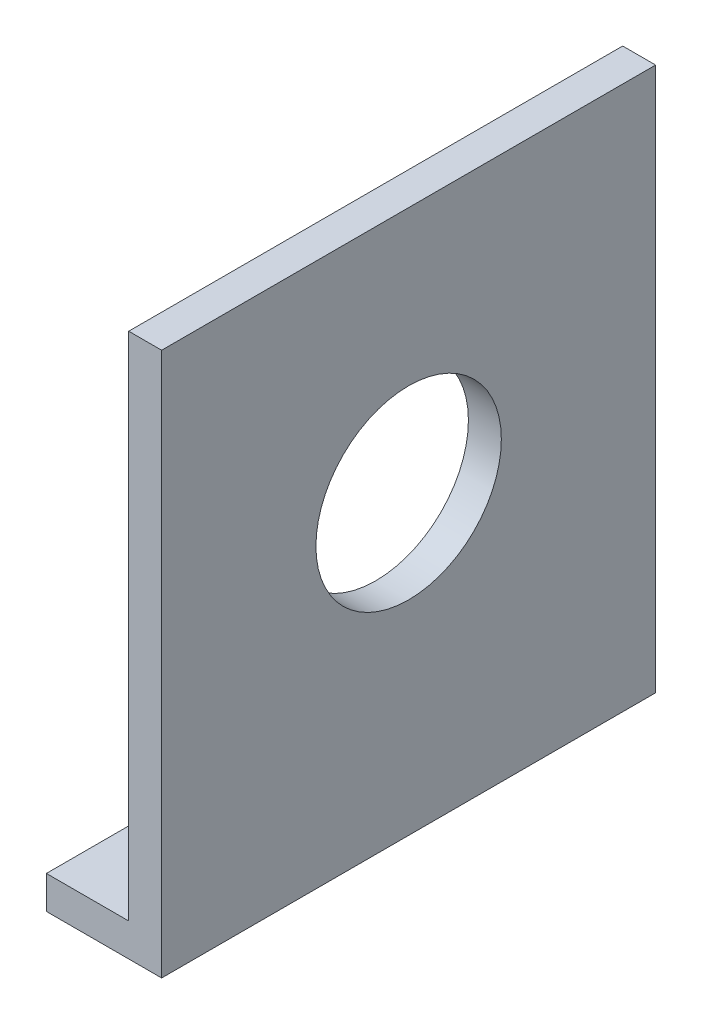
ISO-10303-21;
HEADER;
FILE_DESCRIPTION(('STEP AP214'),'2;1');
FILE_NAME('part.step','',(''),(''),'','','');
FILE_SCHEMA(('AUTOMOTIVE_DESIGN { 1 0 10303 214 1 1 1 1 }'));
ENDSEC;
DATA;
#1=APPLICATION_CONTEXT('core data for automotive mechanical design processes');
#2=APPLICATION_PROTOCOL_DEFINITION('international standard','automotive_design',2000,#1);
#3=PRODUCT_CONTEXT('',#1,'mechanical');
#4=PRODUCT('Part','Part','',(#3));
#5=PRODUCT_RELATED_PRODUCT_CATEGORY('part','',(#4));
#6=PRODUCT_DEFINITION_FORMATION('','',#4);
#7=PRODUCT_DEFINITION_CONTEXT('part definition',#1,'design');
#8=PRODUCT_DEFINITION('design','',#6,#7);
#9=PRODUCT_DEFINITION_SHAPE('','',#8);
#10=(LENGTH_UNIT() NAMED_UNIT(*) SI_UNIT(.MILLI.,.METRE.));
#11=(NAMED_UNIT(*) PLANE_ANGLE_UNIT() SI_UNIT($,.RADIAN.));
#12=(NAMED_UNIT(*) SI_UNIT($,.STERADIAN.) SOLID_ANGLE_UNIT());
#13=UNCERTAINTY_MEASURE_WITH_UNIT(LENGTH_MEASURE(1.E-05),#10,'distance_accuracy_value','');
#14=(GEOMETRIC_REPRESENTATION_CONTEXT(3) GLOBAL_UNCERTAINTY_ASSIGNED_CONTEXT((#13)) GLOBAL_UNIT_ASSIGNED_CONTEXT((#10,
#11,#12)) REPRESENTATION_CONTEXT('',''));
#15=CARTESIAN_POINT('',(0.,0.,0.));
#16=DIRECTION('',(0.,0.,1.));
#17=DIRECTION('',(1.,0.,0.));
#18=AXIS2_PLACEMENT_3D('',#15,#16,#17);
#19=CARTESIAN_POINT('',(-75.6354,19.05,-19.05));
#20=DIRECTION('',(0.,0.,-1.));
#21=DIRECTION('',(0.,1.,0.));
#22=AXIS2_PLACEMENT_3D('',#19,#20,#21);
#23=PLANE('',#22);
#24=DIRECTION('',(1.,0.,0.));
#25=VECTOR('',#24,1.);
#26=CARTESIAN_POINT('',(-75.6354,19.05,-19.05));
#27=LINE('',#26,#25);
#28=CARTESIAN_POINT('',(-75.6354,19.05,-19.05));
#29=VERTEX_POINT('',#28);
#30=CARTESIAN_POINT('',(-73.0954,19.05,-19.05));
#31=VERTEX_POINT('',#30);
#32=EDGE_CURVE('E44',#29,#31,#27,.T.);
#33=ORIENTED_EDGE('',*,*,#32,.T.);
#34=DIRECTION('',(0.,1.,0.));
#35=VECTOR('',#34,1.);
#36=CARTESIAN_POINT('',(-73.0954,19.05,-19.05));
#37=LINE('',#36,#35);
#38=CARTESIAN_POINT('',(-73.0954,-22.882660102,-19.05));
#39=VERTEX_POINT('',#38);
#40=EDGE_CURVE('E121',#39,#31,#37,.T.);
#41=ORIENTED_EDGE('',*,*,#40,.F.);
#42=DIRECTION('',(1.,0.,0.));
#43=VECTOR('',#42,1.);
#44=CARTESIAN_POINT('',(-75.6354,-22.882660102,-19.05));
#45=LINE('',#44,#43);
#46=CARTESIAN_POINT('',(-81.9854,-22.882660102,-19.05));
#47=VERTEX_POINT('',#46);
#48=EDGE_CURVE('E11',#47,#39,#45,.T.);
#49=ORIENTED_EDGE('',*,*,#48,.F.);
#50=DIRECTION('',(0.,1.,0.));
#51=VECTOR('',#50,1.);
#52=CARTESIAN_POINT('',(-81.9854,-20.342660102,-19.05));
#53=LINE('',#52,#51);
#54=CARTESIAN_POINT('',(-81.9854,-20.342660102,-19.05));
#55=VERTEX_POINT('',#54);
#56=EDGE_CURVE('E120',#47,#55,#53,.T.);
#57=ORIENTED_EDGE('',*,*,#56,.T.);
#58=DIRECTION('',(1.,0.,0.));
#59=VECTOR('',#58,1.);
#60=CARTESIAN_POINT('',(-81.9854,-20.342660102,-19.05));
#61=LINE('',#60,#59);
#62=CARTESIAN_POINT('',(-75.6354,-20.342660102,-19.05));
#63=VERTEX_POINT('',#62);
#64=EDGE_CURVE('E147',#55,#63,#61,.T.);
#65=ORIENTED_EDGE('',*,*,#64,.T.);
#66=DIRECTION('',(0.,1.,0.));
#67=VECTOR('',#66,1.);
#68=CARTESIAN_POINT('',(-75.6354,19.05,-19.05));
#69=LINE('',#68,#67);
#70=EDGE_CURVE('E183',#63,#29,#69,.T.);
#71=ORIENTED_EDGE('',*,*,#70,.T.);
#72=EDGE_LOOP('',(#33,#41,#49,#57,#65,#71));
#73=FACE_BOUND('',#72,.T.);
#74=ADVANCED_FACE('F41',(#73),#23,.T.);
#75=CARTESIAN_POINT('',(-75.6354,-22.882660102,-19.05));
#76=DIRECTION('',(0.,-1.,0.));
#77=DIRECTION('',(0.,0.,-1.));
#78=AXIS2_PLACEMENT_3D('',#75,#76,#77);
#79=PLANE('',#78);
#80=DIRECTION('',(0.,0.,-1.));
#81=VECTOR('',#80,1.);
#82=CARTESIAN_POINT('',(-75.6354,-22.882660102,-19.05));
#83=LINE('',#82,#81);
#84=CARTESIAN_POINT('',(-75.6354,-22.882660102,10.16));
#85=VERTEX_POINT('',#84);
#86=CARTESIAN_POINT('',(-75.6354,-22.882660102,-10.16));
#87=VERTEX_POINT('',#86);
#88=EDGE_CURVE('E191',#85,#87,#83,.T.);
#89=ORIENTED_EDGE('',*,*,#88,.T.);
#90=DIRECTION('',(1.,0.,0.));
#91=VECTOR('',#90,1.);
#92=CARTESIAN_POINT('',(-81.9854,-22.882660102,-10.16));
#93=LINE('',#92,#91);
#94=CARTESIAN_POINT('',(-81.9854,-22.882660102,-10.16));
#95=VERTEX_POINT('',#94);
#96=EDGE_CURVE('E137',#95,#87,#93,.T.);
#97=ORIENTED_EDGE('',*,*,#96,.F.);
#98=DIRECTION('',(0.,0.,-1.));
#99=VECTOR('',#98,1.);
#100=CARTESIAN_POINT('',(-81.9854,-22.882660102,-19.05));
#101=LINE('',#100,#99);
#102=EDGE_CURVE('E130',#95,#47,#101,.T.);
#103=ORIENTED_EDGE('',*,*,#102,.T.);
#104=ORIENTED_EDGE('',*,*,#48,.T.);
#105=DIRECTION('',(0.,0.,-1.));
#106=VECTOR('',#105,1.);
#107=CARTESIAN_POINT('',(-73.0954,-22.882660102,-19.05));
#108=LINE('',#107,#106);
#109=CARTESIAN_POINT('',(-73.0954,-22.882660102,19.05));
#110=VERTEX_POINT('',#109);
#111=EDGE_CURVE('E186',#110,#39,#108,.T.);
#112=ORIENTED_EDGE('',*,*,#111,.F.);
#113=DIRECTION('',(1.,0.,0.));
#114=VECTOR('',#113,1.);
#115=CARTESIAN_POINT('',(-75.6354,-22.882660102,19.05));
#116=LINE('',#115,#114);
#117=CARTESIAN_POINT('',(-81.9854,-22.882660102,19.05));
#118=VERTEX_POINT('',#117);
#119=EDGE_CURVE('E49',#118,#110,#116,.T.);
#120=ORIENTED_EDGE('',*,*,#119,.F.);
#121=DIRECTION('',(0.,0.,-1.));
#122=VECTOR('',#121,1.);
#123=CARTESIAN_POINT('',(-81.9854,-22.882660102,10.16));
#124=LINE('',#123,#122);
#125=CARTESIAN_POINT('',(-81.9854,-22.882660102,10.16));
#126=VERTEX_POINT('',#125);
#127=EDGE_CURVE('E138',#118,#126,#124,.T.);
#128=ORIENTED_EDGE('',*,*,#127,.T.);
#129=DIRECTION('',(1.,0.,0.));
#130=VECTOR('',#129,1.);
#131=CARTESIAN_POINT('',(-81.9854,-22.882660102,10.16));
#132=LINE('',#131,#130);
#133=EDGE_CURVE('E153',#126,#85,#132,.T.);
#134=ORIENTED_EDGE('',*,*,#133,.T.);
#135=EDGE_LOOP('',(#89,#97,#103,#104,#112,#120,#128,#134));
#136=FACE_BOUND('',#135,.T.);
#137=ADVANCED_FACE('F136',(#136),#79,.T.);
#138=CARTESIAN_POINT('',(-75.6354,19.05,19.05));
#139=DIRECTION('',(0.,0.,1.));
#140=DIRECTION('',(1.,0.,0.));
#141=AXIS2_PLACEMENT_3D('',#138,#139,#140);
#142=PLANE('',#141);
#143=DIRECTION('',(0.,-1.,0.));
#144=VECTOR('',#143,1.);
#145=CARTESIAN_POINT('',(-75.6354,19.05,19.05));
#146=LINE('',#145,#144);
#147=CARTESIAN_POINT('',(-75.6354,19.05,19.05));
#148=VERTEX_POINT('',#147);
#149=CARTESIAN_POINT('',(-75.6354,-20.342660102,19.05));
#150=VERTEX_POINT('',#149);
#151=EDGE_CURVE('E189',#148,#150,#146,.T.);
#152=ORIENTED_EDGE('',*,*,#151,.T.);
#153=DIRECTION('',(1.,0.,0.));
#154=VECTOR('',#153,1.);
#155=CARTESIAN_POINT('',(-81.9854,-20.342660102,19.05));
#156=LINE('',#155,#154);
#157=CARTESIAN_POINT('',(-81.9854,-20.342660102,19.05));
#158=VERTEX_POINT('',#157);
#159=EDGE_CURVE('E160',#158,#150,#156,.T.);
#160=ORIENTED_EDGE('',*,*,#159,.F.);
#161=DIRECTION('',(0.,-1.,0.));
#162=VECTOR('',#161,1.);
#163=CARTESIAN_POINT('',(-81.9854,-20.342660102,19.05));
#164=LINE('',#163,#162);
#165=EDGE_CURVE('E156',#158,#118,#164,.T.);
#166=ORIENTED_EDGE('',*,*,#165,.T.);
#167=ORIENTED_EDGE('',*,*,#119,.T.);
#168=DIRECTION('',(0.,-1.,0.));
#169=VECTOR('',#168,1.);
#170=CARTESIAN_POINT('',(-73.0954,19.05,19.05));
#171=LINE('',#170,#169);
#172=CARTESIAN_POINT('',(-73.0954,19.05,19.05));
#173=VERTEX_POINT('',#172);
#174=EDGE_CURVE('E197',#173,#110,#171,.T.);
#175=ORIENTED_EDGE('',*,*,#174,.F.);
#176=DIRECTION('',(1.,0.,0.));
#177=VECTOR('',#176,1.);
#178=CARTESIAN_POINT('',(-75.6354,19.05,19.05));
#179=LINE('',#178,#177);
#180=EDGE_CURVE('E201',#148,#173,#179,.T.);
#181=ORIENTED_EDGE('',*,*,#180,.F.);
#182=EDGE_LOOP('',(#152,#160,#166,#167,#175,#181));
#183=FACE_BOUND('',#182,.T.);
#184=ADVANCED_FACE('F218',(#183),#142,.T.);
#185=CARTESIAN_POINT('',(-75.6354,19.05,-19.05));
#186=DIRECTION('',(0.,1.,0.));
#187=DIRECTION('',(0.,0.,1.));
#188=AXIS2_PLACEMENT_3D('',#185,#186,#187);
#189=PLANE('',#188);
#190=DIRECTION('',(0.,0.,1.));
#191=VECTOR('',#190,1.);
#192=CARTESIAN_POINT('',(-73.0954,19.05,-19.05));
#193=LINE('',#192,#191);
#194=EDGE_CURVE('E194',#31,#173,#193,.T.);
#195=ORIENTED_EDGE('',*,*,#194,.F.);
#196=ORIENTED_EDGE('',*,*,#32,.F.);
#197=DIRECTION('',(0.,0.,1.));
#198=VECTOR('',#197,1.);
#199=CARTESIAN_POINT('',(-75.6354,19.05,-19.05));
#200=LINE('',#199,#198);
#201=EDGE_CURVE('E185',#29,#148,#200,.T.);
#202=ORIENTED_EDGE('',*,*,#201,.T.);
#203=ORIENTED_EDGE('',*,*,#180,.T.);
#204=EDGE_LOOP('',(#195,#196,#202,#203));
#205=FACE_BOUND('',#204,.T.);
#206=ADVANCED_FACE('F208',(#205),#189,.T.);
#207=CARTESIAN_POINT('',(-75.6354,0.,0.));
#208=DIRECTION('',(-1.,0.,0.));
#209=DIRECTION('',(0.,0.,1.));
#210=AXIS2_PLACEMENT_3D('',#207,#208,#209);
#211=PLANE('',#210);
#212=DIRECTION('',(0.,1.,0.));
#213=VECTOR('',#212,1.);
#214=CARTESIAN_POINT('',(-75.6354,0.,-10.16));
#215=LINE('',#214,#213);
#216=CARTESIAN_POINT('',(-75.6354,-20.342660102,-10.16));
#217=VERTEX_POINT('',#216);
#218=EDGE_CURVE('E175',#87,#217,#215,.T.);
#219=ORIENTED_EDGE('',*,*,#218,.F.);
#220=ORIENTED_EDGE('',*,*,#88,.F.);
#221=DIRECTION('',(0.,-1.,0.));
#222=VECTOR('',#221,1.);
#223=CARTESIAN_POINT('',(-75.6354,0.,10.16));
#224=LINE('',#223,#222);
#225=CARTESIAN_POINT('',(-75.6354,-20.342660102,10.16));
#226=VERTEX_POINT('',#225);
#227=EDGE_CURVE('E57',#226,#85,#224,.T.);
#228=ORIENTED_EDGE('',*,*,#227,.F.);
#229=DIRECTION('',(0.,0.,-1.));
#230=VECTOR('',#229,1.);
#231=CARTESIAN_POINT('',(-75.6354,-20.342660102,0.));
#232=LINE('',#231,#230);
#233=EDGE_CURVE('E61',#150,#226,#232,.T.);
#234=ORIENTED_EDGE('',*,*,#233,.F.);
#235=ORIENTED_EDGE('',*,*,#151,.F.);
#236=ORIENTED_EDGE('',*,*,#201,.F.);
#237=ORIENTED_EDGE('',*,*,#70,.F.);
#238=DIRECTION('',(0.,0.,-1.));
#239=VECTOR('',#238,1.);
#240=CARTESIAN_POINT('',(-75.6354,-20.342660102,0.));
#241=LINE('',#240,#239);
#242=EDGE_CURVE('E172',#217,#63,#241,.T.);
#243=ORIENTED_EDGE('',*,*,#242,.F.);
#244=EDGE_LOOP('',(#219,#220,#228,#234,#235,#236,#237,#243));
#245=FACE_BOUND('',#244,.T.);
#246=CARTESIAN_POINT('',(-75.6354,0.,0.));
#247=DIRECTION('',(1.,0.,0.));
#248=DIRECTION('',(0.,0.,-1.));
#249=AXIS2_PLACEMENT_3D('',#246,#247,#248);
#250=CIRCLE('',#249,7.1501);
#251=CARTESIAN_POINT('',(-75.6354,0.,-7.1501));
#252=VERTEX_POINT('',#251);
#253=EDGE_CURVE('E178',#252,#252,#250,.T.);
#254=ORIENTED_EDGE('',*,*,#253,.T.);
#255=EDGE_LOOP('',(#254));
#256=FACE_BOUND('',#255,.T.);
#257=ADVANCED_FACE('F224',(#245,#256),#211,.T.);
#258=CARTESIAN_POINT('',(-73.0954,0.,0.));
#259=DIRECTION('',(-1.,0.,0.));
#260=DIRECTION('',(0.,0.,1.));
#261=AXIS2_PLACEMENT_3D('',#258,#259,#260);
#262=PLANE('',#261);
#263=CARTESIAN_POINT('',(-73.0954,0.,0.));
#264=DIRECTION('',(1.,0.,0.));
#265=DIRECTION('',(0.,0.,-1.));
#266=AXIS2_PLACEMENT_3D('',#263,#264,#265);
#267=CIRCLE('',#266,7.1501);
#268=CARTESIAN_POINT('',(-73.0954,0.,-7.1501));
#269=VERTEX_POINT('',#268);
#270=EDGE_CURVE('E177',#269,#269,#267,.T.);
#271=ORIENTED_EDGE('',*,*,#270,.F.);
#272=EDGE_LOOP('',(#271));
#273=FACE_BOUND('',#272,.T.);
#274=ORIENTED_EDGE('',*,*,#111,.T.);
#275=ORIENTED_EDGE('',*,*,#40,.T.);
#276=ORIENTED_EDGE('',*,*,#194,.T.);
#277=ORIENTED_EDGE('',*,*,#174,.T.);
#278=EDGE_LOOP('',(#274,#275,#276,#277));
#279=FACE_BOUND('',#278,.T.);
#280=ADVANCED_FACE('F210',(#273,#279),#262,.F.);
#281=CARTESIAN_POINT('',(-75.6354,0.,0.));
#282=DIRECTION('',(1.,0.,0.));
#283=DIRECTION('',(0.,0.,-1.));
#284=AXIS2_PLACEMENT_3D('',#281,#282,#283);
#285=CYLINDRICAL_SURFACE('',#284,7.1501);
#286=ORIENTED_EDGE('',*,*,#253,.F.);
#287=EDGE_LOOP('',(#286));
#288=FACE_BOUND('',#287,.T.);
#289=ORIENTED_EDGE('',*,*,#270,.T.);
#290=EDGE_LOOP('',(#289));
#291=FACE_BOUND('',#290,.T.);
#292=ADVANCED_FACE('F259',(#288,#291),#285,.F.);
#293=CARTESIAN_POINT('',(-81.9854,-20.342660102,19.05));
#294=DIRECTION('',(0.,1.,0.));
#295=DIRECTION('',(0.,0.,1.));
#296=AXIS2_PLACEMENT_3D('',#293,#294,#295);
#297=PLANE('',#296);
#298=ORIENTED_EDGE('',*,*,#159,.T.);
#299=ORIENTED_EDGE('',*,*,#233,.T.);
#300=DIRECTION('',(1.,0.,0.));
#301=VECTOR('',#300,1.);
#302=CARTESIAN_POINT('',(-81.9854,-20.342660102,10.16));
#303=LINE('',#302,#301);
#304=CARTESIAN_POINT('',(-81.9854,-20.342660102,10.16));
#305=VERTEX_POINT('',#304);
#306=EDGE_CURVE('E157',#305,#226,#303,.T.);
#307=ORIENTED_EDGE('',*,*,#306,.F.);
#308=DIRECTION('',(0.,0.,1.));
#309=VECTOR('',#308,1.);
#310=CARTESIAN_POINT('',(-81.9854,-20.342660102,19.05));
#311=LINE('',#310,#309);
#312=EDGE_CURVE('E165',#305,#158,#311,.T.);
#313=ORIENTED_EDGE('',*,*,#312,.T.);
#314=EDGE_LOOP('',(#298,#299,#307,#313));
#315=FACE_BOUND('',#314,.T.);
#316=ADVANCED_FACE('F220',(#315),#297,.T.);
#317=CARTESIAN_POINT('',(-81.9854,-20.342660102,10.16));
#318=DIRECTION('',(0.,0.,-1.));
#319=DIRECTION('',(-1.,0.,0.));
#320=AXIS2_PLACEMENT_3D('',#317,#318,#319);
#321=PLANE('',#320);
#322=ORIENTED_EDGE('',*,*,#306,.T.);
#323=ORIENTED_EDGE('',*,*,#227,.T.);
#324=ORIENTED_EDGE('',*,*,#133,.F.);
#325=DIRECTION('',(0.,1.,0.));
#326=VECTOR('',#325,1.);
#327=CARTESIAN_POINT('',(-81.9854,-20.342660102,10.16));
#328=LINE('',#327,#326);
#329=EDGE_CURVE('E141',#126,#305,#328,.T.);
#330=ORIENTED_EDGE('',*,*,#329,.T.);
#331=EDGE_LOOP('',(#322,#323,#324,#330));
#332=FACE_BOUND('',#331,.T.);
#333=ADVANCED_FACE('F222',(#332),#321,.T.);
#334=CARTESIAN_POINT('',(-81.9854,0.,0.));
#335=DIRECTION('',(1.,0.,0.));
#336=DIRECTION('',(0.,0.,-1.));
#337=AXIS2_PLACEMENT_3D('',#334,#335,#336);
#338=PLANE('',#337);
#339=ORIENTED_EDGE('',*,*,#127,.F.);
#340=ORIENTED_EDGE('',*,*,#165,.F.);
#341=ORIENTED_EDGE('',*,*,#312,.F.);
#342=ORIENTED_EDGE('',*,*,#329,.F.);
#343=EDGE_LOOP('',(#339,#340,#341,#342));
#344=FACE_BOUND('',#343,.T.);
#345=ADVANCED_FACE('F216',(#344),#338,.F.);
#346=CARTESIAN_POINT('',(-81.9854,-20.342660102,-10.16));
#347=DIRECTION('',(0.,0.,1.));
#348=DIRECTION('',(1.,0.,0.));
#349=AXIS2_PLACEMENT_3D('',#346,#347,#348);
#350=PLANE('',#349);
#351=ORIENTED_EDGE('',*,*,#96,.T.);
#352=ORIENTED_EDGE('',*,*,#218,.T.);
#353=DIRECTION('',(1.,0.,0.));
#354=VECTOR('',#353,1.);
#355=CARTESIAN_POINT('',(-81.9854,-20.342660102,-10.16));
#356=LINE('',#355,#354);
#357=CARTESIAN_POINT('',(-81.9854,-20.342660102,-10.16));
#358=VERTEX_POINT('',#357);
#359=EDGE_CURVE('E149',#358,#217,#356,.T.);
#360=ORIENTED_EDGE('',*,*,#359,.F.);
#361=DIRECTION('',(0.,-1.,0.));
#362=VECTOR('',#361,1.);
#363=CARTESIAN_POINT('',(-81.9854,-20.342660102,-10.16));
#364=LINE('',#363,#362);
#365=EDGE_CURVE('E145',#358,#95,#364,.T.);
#366=ORIENTED_EDGE('',*,*,#365,.T.);
#367=EDGE_LOOP('',(#351,#352,#360,#366));
#368=FACE_BOUND('',#367,.T.);
#369=ADVANCED_FACE('F228',(#368),#350,.T.);
#370=CARTESIAN_POINT('',(-81.9854,-20.342660102,-19.05));
#371=DIRECTION('',(0.,1.,0.));
#372=DIRECTION('',(0.,0.,1.));
#373=AXIS2_PLACEMENT_3D('',#370,#371,#372);
#374=PLANE('',#373);
#375=ORIENTED_EDGE('',*,*,#359,.T.);
#376=ORIENTED_EDGE('',*,*,#242,.T.);
#377=ORIENTED_EDGE('',*,*,#64,.F.);
#378=DIRECTION('',(0.,0.,1.));
#379=VECTOR('',#378,1.);
#380=CARTESIAN_POINT('',(-81.9854,-20.342660102,-19.05));
#381=LINE('',#380,#379);
#382=EDGE_CURVE('E133',#55,#358,#381,.T.);
#383=ORIENTED_EDGE('',*,*,#382,.T.);
#384=EDGE_LOOP('',(#375,#376,#377,#383));
#385=FACE_BOUND('',#384,.T.);
#386=ADVANCED_FACE('F230',(#385),#374,.T.);
#387=CARTESIAN_POINT('',(-81.9854,0.,0.));
#388=DIRECTION('',(1.,0.,0.));
#389=DIRECTION('',(0.,0.,-1.));
#390=AXIS2_PLACEMENT_3D('',#387,#388,#389);
#391=PLANE('',#390);
#392=ORIENTED_EDGE('',*,*,#102,.F.);
#393=ORIENTED_EDGE('',*,*,#365,.F.);
#394=ORIENTED_EDGE('',*,*,#382,.F.);
#395=ORIENTED_EDGE('',*,*,#56,.F.);
#396=EDGE_LOOP('',(#392,#393,#394,#395));
#397=FACE_BOUND('',#396,.T.);
#398=ADVANCED_FACE('F128',(#397),#391,.F.);
#399=CLOSED_SHELL('',(#74,#137,#184,#206,#257,#280,#292,#316,#333,#345,#369,#386,#398));
#400=MANIFOLD_SOLID_BREP('B2',#399);
#401=ADVANCED_BREP_SHAPE_REPRESENTATION('',(#18,#400),#14);
#402=SHAPE_DEFINITION_REPRESENTATION(#9,#401);
ENDSEC;
END-ISO-10303-21;
